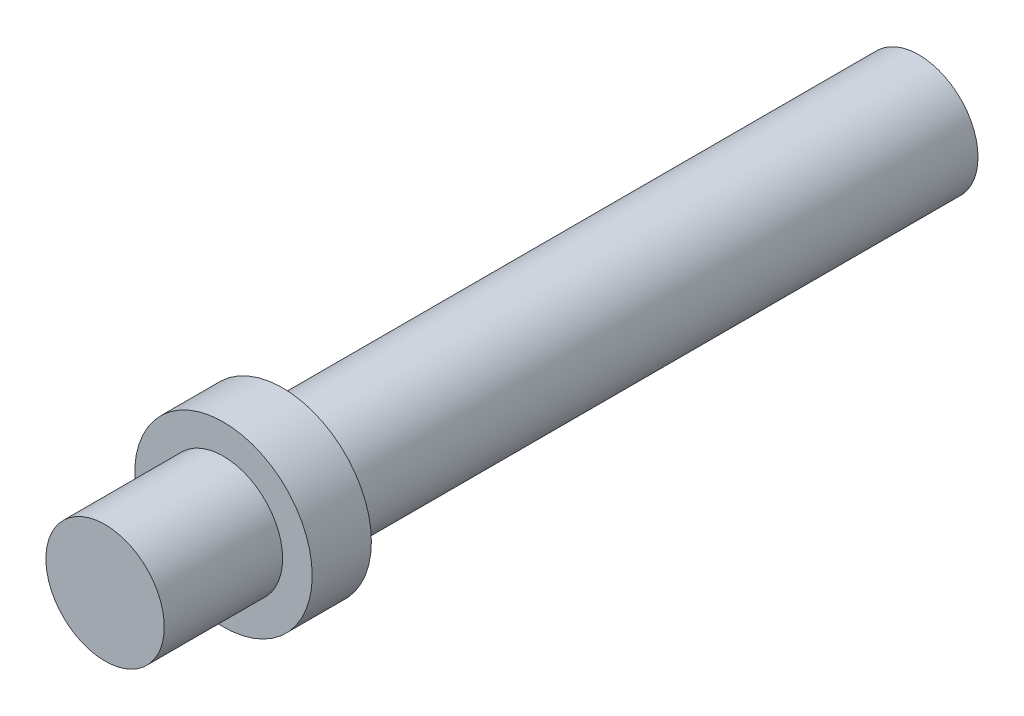
ISO-10303-21;
HEADER;
FILE_DESCRIPTION(('STEP AP214'),'2;1');
FILE_NAME('part.step','',(''),(''),'','','');
FILE_SCHEMA(('AUTOMOTIVE_DESIGN { 1 0 10303 214 1 1 1 1 }'));
ENDSEC;
DATA;
#1=APPLICATION_CONTEXT('core data for automotive mechanical design processes');
#2=APPLICATION_PROTOCOL_DEFINITION('international standard','automotive_design',2000,#1);
#3=PRODUCT_CONTEXT('',#1,'mechanical');
#4=PRODUCT('Part','Part','',(#3));
#5=PRODUCT_RELATED_PRODUCT_CATEGORY('part','',(#4));
#6=PRODUCT_DEFINITION_FORMATION('','',#4);
#7=PRODUCT_DEFINITION_CONTEXT('part definition',#1,'design');
#8=PRODUCT_DEFINITION('design','',#6,#7);
#9=PRODUCT_DEFINITION_SHAPE('','',#8);
#10=(LENGTH_UNIT() NAMED_UNIT(*) SI_UNIT(.MILLI.,.METRE.));
#11=(NAMED_UNIT(*) PLANE_ANGLE_UNIT() SI_UNIT($,.RADIAN.));
#12=(NAMED_UNIT(*) SI_UNIT($,.STERADIAN.) SOLID_ANGLE_UNIT());
#13=UNCERTAINTY_MEASURE_WITH_UNIT(LENGTH_MEASURE(1.E-05),#10,'distance_accuracy_value','');
#14=(GEOMETRIC_REPRESENTATION_CONTEXT(3) GLOBAL_UNCERTAINTY_ASSIGNED_CONTEXT((#13)) GLOBAL_UNIT_ASSIGNED_CONTEXT((#10,
#11,#12)) REPRESENTATION_CONTEXT('',''));
#15=CARTESIAN_POINT('',(0.,0.,0.));
#16=DIRECTION('',(0.,0.,1.));
#17=DIRECTION('',(1.,0.,0.));
#18=AXIS2_PLACEMENT_3D('',#15,#16,#17);
#19=CARTESIAN_POINT('',(0.,0.,0.));
#20=DIRECTION('',(0.,0.,-1.));
#21=DIRECTION('',(-1.,0.,0.));
#22=AXIS2_PLACEMENT_3D('',#19,#20,#21);
#23=PLANE('',#22);
#24=CARTESIAN_POINT('',(0.,0.,0.));
#25=DIRECTION('',(0.,0.,1.));
#26=DIRECTION('',(1.,0.,0.));
#27=AXIS2_PLACEMENT_3D('',#24,#25,#26);
#28=CIRCLE('',#27,2.);
#29=CARTESIAN_POINT('',(2.,0.,0.));
#30=VERTEX_POINT('',#29);
#31=EDGE_CURVE('E10',#30,#30,#28,.T.);
#32=ORIENTED_EDGE('',*,*,#31,.T.);
#33=EDGE_LOOP('',(#32));
#34=FACE_BOUND('',#33,.T.);
#35=ADVANCED_FACE('F30',(#34),#23,.F.);
#36=CARTESIAN_POINT('',(0.,0.,0.));
#37=DIRECTION('',(0.,0.,1.));
#38=DIRECTION('',(1.,0.,0.));
#39=AXIS2_PLACEMENT_3D('',#36,#37,#38);
#40=CYLINDRICAL_SURFACE('',#39,2.);
#41=ORIENTED_EDGE('',*,*,#31,.F.);
#42=EDGE_LOOP('',(#41));
#43=FACE_BOUND('',#42,.T.);
#44=CARTESIAN_POINT('',(0.,0.,-4.));
#45=DIRECTION('',(0.,0.,1.));
#46=DIRECTION('',(1.,0.,0.));
#47=AXIS2_PLACEMENT_3D('',#44,#45,#46);
#48=CIRCLE('',#47,2.);
#49=CARTESIAN_POINT('',(2.,0.,-4.));
#50=VERTEX_POINT('',#49);
#51=EDGE_CURVE('E36',#50,#50,#48,.T.);
#52=ORIENTED_EDGE('',*,*,#51,.T.);
#53=EDGE_LOOP('',(#52));
#54=FACE_BOUND('',#53,.T.);
#55=ADVANCED_FACE('F68',(#43,#54),#40,.T.);
#56=CARTESIAN_POINT('',(0.,2.,-4.));
#57=DIRECTION('',(0.,0.,-1.));
#58=DIRECTION('',(-1.,0.,0.));
#59=AXIS2_PLACEMENT_3D('',#56,#57,#58);
#60=PLANE('',#59);
#61=ORIENTED_EDGE('',*,*,#51,.F.);
#62=EDGE_LOOP('',(#61));
#63=FACE_BOUND('',#62,.T.);
#64=CARTESIAN_POINT('',(0.,0.,-4.));
#65=DIRECTION('',(0.,0.,1.));
#66=DIRECTION('',(1.,0.,0.));
#67=AXIS2_PLACEMENT_3D('',#64,#65,#66);
#68=CIRCLE('',#67,3.);
#69=CARTESIAN_POINT('',(3.,0.,-4.));
#70=VERTEX_POINT('',#69);
#71=EDGE_CURVE('E40',#70,#70,#68,.T.);
#72=ORIENTED_EDGE('',*,*,#71,.T.);
#73=EDGE_LOOP('',(#72));
#74=FACE_BOUND('',#73,.T.);
#75=ADVANCED_FACE('F72',(#63,#74),#60,.F.);
#76=CARTESIAN_POINT('',(0.,0.,0.));
#77=DIRECTION('',(0.,0.,1.));
#78=DIRECTION('',(1.,0.,0.));
#79=AXIS2_PLACEMENT_3D('',#76,#77,#78);
#80=CYLINDRICAL_SURFACE('',#79,3.);
#81=ORIENTED_EDGE('',*,*,#71,.F.);
#82=EDGE_LOOP('',(#81));
#83=FACE_BOUND('',#82,.T.);
#84=CARTESIAN_POINT('',(0.,0.,-6.));
#85=DIRECTION('',(0.,0.,1.));
#86=DIRECTION('',(1.,0.,0.));
#87=AXIS2_PLACEMENT_3D('',#84,#85,#86);
#88=CIRCLE('',#87,3.);
#89=CARTESIAN_POINT('',(3.,0.,-6.));
#90=VERTEX_POINT('',#89);
#91=EDGE_CURVE('E44',#90,#90,#88,.T.);
#92=ORIENTED_EDGE('',*,*,#91,.T.);
#93=EDGE_LOOP('',(#92));
#94=FACE_BOUND('',#93,.T.);
#95=ADVANCED_FACE('F77',(#83,#94),#80,.T.);
#96=CARTESIAN_POINT('',(0.,3.,-6.));
#97=DIRECTION('',(0.,0.,1.));
#98=DIRECTION('',(1.,0.,0.));
#99=AXIS2_PLACEMENT_3D('',#96,#97,#98);
#100=PLANE('',#99);
#101=ORIENTED_EDGE('',*,*,#91,.F.);
#102=EDGE_LOOP('',(#101));
#103=FACE_BOUND('',#102,.T.);
#104=CARTESIAN_POINT('',(0.,0.,-6.));
#105=DIRECTION('',(0.,0.,1.));
#106=DIRECTION('',(1.,0.,0.));
#107=AXIS2_PLACEMENT_3D('',#104,#105,#106);
#108=CIRCLE('',#107,2.);
#109=CARTESIAN_POINT('',(2.,0.,-6.));
#110=VERTEX_POINT('',#109);
#111=EDGE_CURVE('E49',#110,#110,#108,.T.);
#112=ORIENTED_EDGE('',*,*,#111,.T.);
#113=EDGE_LOOP('',(#112));
#114=FACE_BOUND('',#113,.T.);
#115=ADVANCED_FACE('F64',(#103,#114),#100,.F.);
#116=CARTESIAN_POINT('',(0.,0.,0.));
#117=DIRECTION('',(0.,0.,1.));
#118=DIRECTION('',(1.,0.,0.));
#119=AXIS2_PLACEMENT_3D('',#116,#117,#118);
#120=CYLINDRICAL_SURFACE('',#119,2.);
#121=ORIENTED_EDGE('',*,*,#111,.F.);
#122=EDGE_LOOP('',(#121));
#123=FACE_BOUND('',#122,.T.);
#124=CARTESIAN_POINT('',(0.,0.,-27.5));
#125=DIRECTION('',(0.,0.,1.));
#126=DIRECTION('',(1.,0.,0.));
#127=AXIS2_PLACEMENT_3D('',#124,#125,#126);
#128=CIRCLE('',#127,2.);
#129=CARTESIAN_POINT('',(2.,0.,-27.5));
#130=VERTEX_POINT('',#129);
#131=EDGE_CURVE('E52',#130,#130,#128,.T.);
#132=ORIENTED_EDGE('',*,*,#131,.T.);
#133=EDGE_LOOP('',(#132));
#134=FACE_BOUND('',#133,.T.);
#135=ADVANCED_FACE('F56',(#123,#134),#120,.T.);
#136=CARTESIAN_POINT('',(0.,2.,-27.5));
#137=DIRECTION('',(0.,0.,1.));
#138=DIRECTION('',(1.,0.,0.));
#139=AXIS2_PLACEMENT_3D('',#136,#137,#138);
#140=PLANE('',#139);
#141=ORIENTED_EDGE('',*,*,#131,.F.);
#142=EDGE_LOOP('',(#141));
#143=FACE_BOUND('',#142,.T.);
#144=ADVANCED_FACE('F58',(#143),#140,.F.);
#145=CLOSED_SHELL('',(#35,#55,#75,#95,#115,#135,#144));
#146=MANIFOLD_SOLID_BREP('B2',#145);
#147=ADVANCED_BREP_SHAPE_REPRESENTATION('',(#18,#146),#14);
#148=SHAPE_DEFINITION_REPRESENTATION(#9,#147);
ENDSEC;
END-ISO-10303-21;
